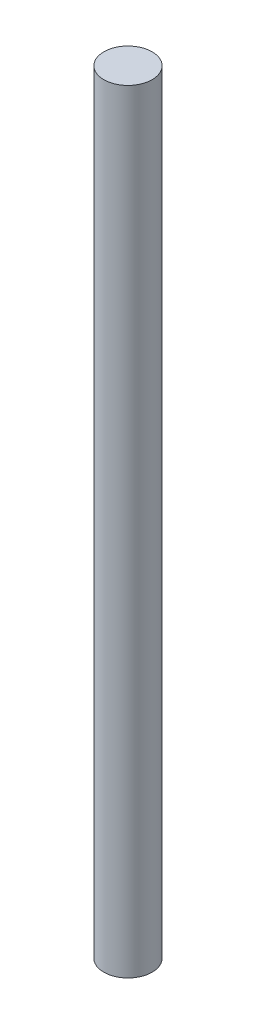
ISO-10303-21;
HEADER;
FILE_DESCRIPTION(('STEP AP214'),'2;1');
FILE_NAME('part.step','',(''),(''),'','','');
FILE_SCHEMA(('AUTOMOTIVE_DESIGN { 1 0 10303 214 1 1 1 1 }'));
ENDSEC;
DATA;
#1=APPLICATION_CONTEXT('core data for automotive mechanical design processes');
#2=APPLICATION_PROTOCOL_DEFINITION('international standard','automotive_design',2000,#1);
#3=PRODUCT_CONTEXT('',#1,'mechanical');
#4=PRODUCT('Part','Part','',(#3));
#5=PRODUCT_RELATED_PRODUCT_CATEGORY('part','',(#4));
#6=PRODUCT_DEFINITION_FORMATION('','',#4);
#7=PRODUCT_DEFINITION_CONTEXT('part definition',#1,'design');
#8=PRODUCT_DEFINITION('design','',#6,#7);
#9=PRODUCT_DEFINITION_SHAPE('','',#8);
#10=(LENGTH_UNIT() NAMED_UNIT(*) SI_UNIT(.MILLI.,.METRE.));
#11=(NAMED_UNIT(*) PLANE_ANGLE_UNIT() SI_UNIT($,.RADIAN.));
#12=(NAMED_UNIT(*) SI_UNIT($,.STERADIAN.) SOLID_ANGLE_UNIT());
#13=UNCERTAINTY_MEASURE_WITH_UNIT(LENGTH_MEASURE(1.E-05),#10,'distance_accuracy_value','');
#14=(GEOMETRIC_REPRESENTATION_CONTEXT(3) GLOBAL_UNCERTAINTY_ASSIGNED_CONTEXT((#13)) GLOBAL_UNIT_ASSIGNED_CONTEXT((#10,
#11,#12)) REPRESENTATION_CONTEXT('',''));
#15=CARTESIAN_POINT('',(0.,0.,0.));
#16=DIRECTION('',(0.,0.,1.));
#17=DIRECTION('',(1.,0.,0.));
#18=AXIS2_PLACEMENT_3D('',#15,#16,#17);
#19=CARTESIAN_POINT('',(0.,152.4,0.));
#20=DIRECTION('',(0.,-1.,0.));
#21=DIRECTION('',(0.,0.,-1.));
#22=AXIS2_PLACEMENT_3D('',#19,#20,#21);
#23=CYLINDRICAL_SURFACE('',#22,4.7625);
#24=CARTESIAN_POINT('',(0.,152.4,0.));
#25=DIRECTION('',(0.,1.,0.));
#26=DIRECTION('',(0.,0.,1.));
#27=AXIS2_PLACEMENT_3D('',#24,#25,#26);
#28=CIRCLE('',#27,4.7625);
#29=CARTESIAN_POINT('',(0.,152.4,4.7625));
#30=VERTEX_POINT('',#29);
#31=EDGE_CURVE('E10',#30,#30,#28,.T.);
#32=ORIENTED_EDGE('',*,*,#31,.F.);
#33=EDGE_LOOP('',(#32));
#34=FACE_BOUND('',#33,.T.);
#35=CARTESIAN_POINT('',(0.,0.,0.));
#36=DIRECTION('',(0.,1.,0.));
#37=DIRECTION('',(0.,0.,1.));
#38=AXIS2_PLACEMENT_3D('',#35,#36,#37);
#39=CIRCLE('',#38,4.7625);
#40=CARTESIAN_POINT('',(0.,0.,4.7625));
#41=VERTEX_POINT('',#40);
#42=EDGE_CURVE('E18',#41,#41,#39,.T.);
#43=ORIENTED_EDGE('',*,*,#42,.T.);
#44=EDGE_LOOP('',(#43));
#45=FACE_BOUND('',#44,.T.);
#46=ADVANCED_FACE('F15',(#34,#45),#23,.T.);
#47=CARTESIAN_POINT('',(0.,152.4,0.));
#48=DIRECTION('',(0.,1.,0.));
#49=DIRECTION('',(0.,0.,1.));
#50=AXIS2_PLACEMENT_3D('',#47,#48,#49);
#51=PLANE('',#50);
#52=ORIENTED_EDGE('',*,*,#31,.T.);
#53=EDGE_LOOP('',(#52));
#54=FACE_BOUND('',#53,.T.);
#55=ADVANCED_FACE('F30',(#54),#51,.T.);
#56=CARTESIAN_POINT('',(0.,0.,0.));
#57=DIRECTION('',(0.,1.,0.));
#58=DIRECTION('',(0.,0.,1.));
#59=AXIS2_PLACEMENT_3D('',#56,#57,#58);
#60=PLANE('',#59);
#61=ORIENTED_EDGE('',*,*,#42,.F.);
#62=EDGE_LOOP('',(#61));
#63=FACE_BOUND('',#62,.T.);
#64=ADVANCED_FACE('F28',(#63),#60,.F.);
#65=CLOSED_SHELL('',(#46,#55,#64));
#66=MANIFOLD_SOLID_BREP('B1',#65);
#67=ADVANCED_BREP_SHAPE_REPRESENTATION('',(#18,#66),#14);
#68=SHAPE_DEFINITION_REPRESENTATION(#9,#67);
ENDSEC;
END-ISO-10303-21;
